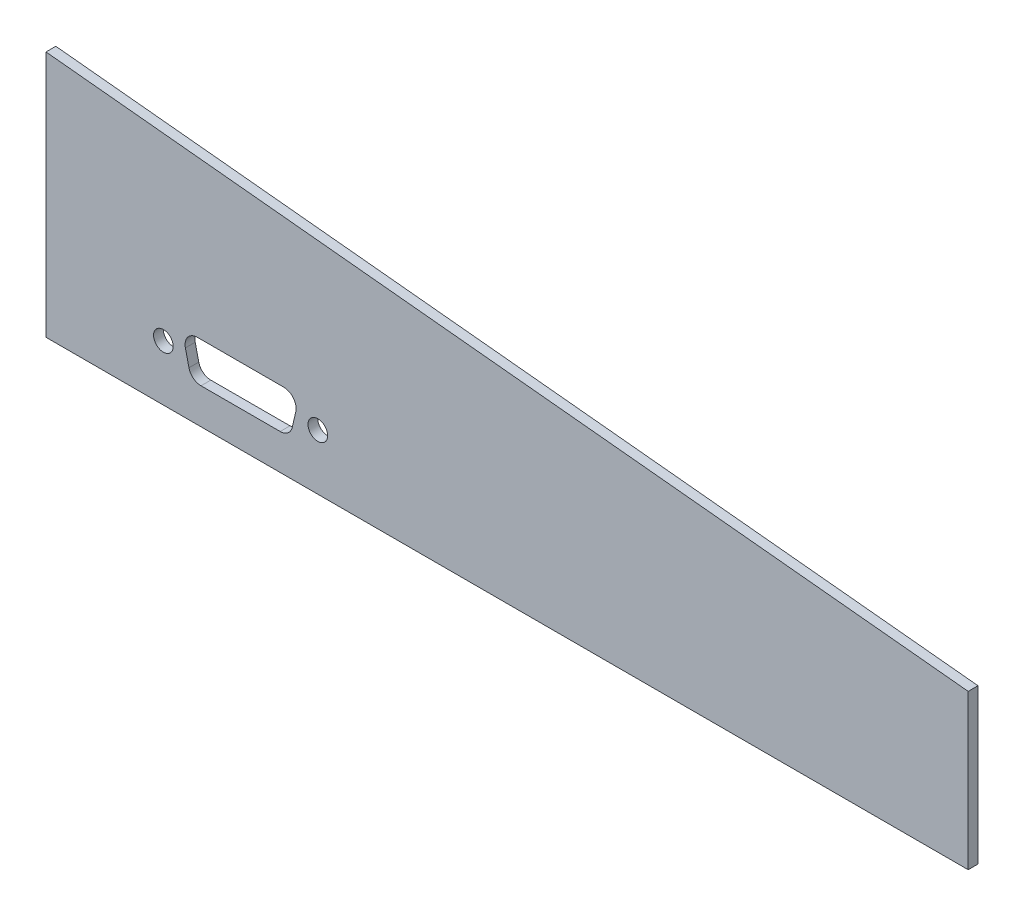
ISO-10303-21;
HEADER;
FILE_DESCRIPTION(('STEP AP214'),'2;1');
FILE_NAME('part.step','',(''),(''),'','','');
FILE_SCHEMA(('AUTOMOTIVE_DESIGN { 1 0 10303 214 1 1 1 1 }'));
ENDSEC;
DATA;
#1=APPLICATION_CONTEXT('core data for automotive mechanical design processes');
#2=APPLICATION_PROTOCOL_DEFINITION('international standard','automotive_design',2000,#1);
#3=PRODUCT_CONTEXT('',#1,'mechanical');
#4=PRODUCT('Part','Part','',(#3));
#5=PRODUCT_RELATED_PRODUCT_CATEGORY('part','',(#4));
#6=PRODUCT_DEFINITION_FORMATION('','',#4);
#7=PRODUCT_DEFINITION_CONTEXT('part definition',#1,'design');
#8=PRODUCT_DEFINITION('design','',#6,#7);
#9=PRODUCT_DEFINITION_SHAPE('','',#8);
#10=(LENGTH_UNIT() NAMED_UNIT(*) SI_UNIT(.MILLI.,.METRE.));
#11=(NAMED_UNIT(*) PLANE_ANGLE_UNIT() SI_UNIT($,.RADIAN.));
#12=(NAMED_UNIT(*) SI_UNIT($,.STERADIAN.) SOLID_ANGLE_UNIT());
#13=UNCERTAINTY_MEASURE_WITH_UNIT(LENGTH_MEASURE(1.E-05),#10,'distance_accuracy_value','');
#14=(GEOMETRIC_REPRESENTATION_CONTEXT(3) GLOBAL_UNCERTAINTY_ASSIGNED_CONTEXT((#13)) GLOBAL_UNIT_ASSIGNED_CONTEXT((#10,
#11,#12)) REPRESENTATION_CONTEXT('',''));
#15=CARTESIAN_POINT('',(0.,0.,0.));
#16=DIRECTION('',(0.,0.,1.));
#17=DIRECTION('',(1.,0.,0.));
#18=AXIS2_PLACEMENT_3D('',#15,#16,#17);
#19=CARTESIAN_POINT('',(0.,0.,1.5875));
#20=DIRECTION('',(0.,0.,1.));
#21=DIRECTION('',(1.,0.,0.));
#22=AXIS2_PLACEMENT_3D('',#19,#20,#21);
#23=PLANE('',#22);
#24=CARTESIAN_POINT('',(-130.248115565993,9.,1.5875));
#25=DIRECTION('',(0.,0.,1.));
#26=DIRECTION('',(1.,0.,0.));
#27=AXIS2_PLACEMENT_3D('',#24,#25,#26);
#28=CIRCLE('',#27,1.59000000000001);
#29=CARTESIAN_POINT('',(-128.658115565993,9.,1.5875));
#30=VERTEX_POINT('',#29);
#31=EDGE_CURVE('E217',#30,#30,#28,.T.);
#32=ORIENTED_EDGE('',*,*,#31,.F.);
#33=EDGE_LOOP('',(#32));
#34=FACE_BOUND('',#33,.T.);
#35=DIRECTION('',(-0.99498743710662,0.1,0.));
#36=VECTOR('',#35,1.);
#37=CARTESIAN_POINT('',(0.,25.,1.5875));
#38=LINE('',#37,#36);
#39=CARTESIAN_POINT('',(0.,25.,1.5875));
#40=VERTEX_POINT('',#39);
#41=CARTESIAN_POINT('',(-149.248115565993,40.,1.5875));
#42=VERTEX_POINT('',#41);
#43=EDGE_CURVE('E133',#40,#42,#38,.T.);
#44=ORIENTED_EDGE('',*,*,#43,.T.);
#45=DIRECTION('',(0.,-1.,0.));
#46=VECTOR('',#45,1.);
#47=CARTESIAN_POINT('',(-149.248115565993,40.,1.5875));
#48=LINE('',#47,#46);
#49=CARTESIAN_POINT('',(-149.248115565993,0.,1.5875));
#50=VERTEX_POINT('',#49);
#51=EDGE_CURVE('E122',#42,#50,#48,.T.);
#52=ORIENTED_EDGE('',*,*,#51,.T.);
#53=DIRECTION('',(1.,0.,0.));
#54=VECTOR('',#53,1.);
#55=CARTESIAN_POINT('',(-149.248115565993,0.,1.5875));
#56=LINE('',#55,#54);
#57=CARTESIAN_POINT('',(0.,0.,1.5875));
#58=VERTEX_POINT('',#57);
#59=EDGE_CURVE('E132',#50,#58,#56,.T.);
#60=ORIENTED_EDGE('',*,*,#59,.T.);
#61=DIRECTION('',(0.,1.,0.));
#62=VECTOR('',#61,1.);
#63=CARTESIAN_POINT('',(0.,0.,1.5875));
#64=LINE('',#63,#62);
#65=EDGE_CURVE('E137',#58,#40,#64,.T.);
#66=ORIENTED_EDGE('',*,*,#65,.T.);
#67=EDGE_LOOP('',(#44,#52,#60,#66));
#68=FACE_BOUND('',#67,.T.);
#69=DIRECTION('',(1.,0.,0.));
#70=VECTOR('',#69,1.);
#71=CARTESIAN_POINT('',(-109.753115565993,5.75,1.5875));
#72=LINE('',#71,#70);
#73=CARTESIAN_POINT('',(-124.162090325358,5.75,1.5875));
#74=VERTEX_POINT('',#73);
#75=CARTESIAN_POINT('',(-111.344140806628,5.75,1.5875));
#76=VERTEX_POINT('',#75);
#77=EDGE_CURVE('E202',#74,#76,#72,.T.);
#78=ORIENTED_EDGE('',*,*,#77,.F.);
#79=CARTESIAN_POINT('',(-124.162090325358,7.75,1.5875));
#80=DIRECTION('',(0.,0.,1.));
#81=DIRECTION('',(1.,0.,0.));
#82=AXIS2_PLACEMENT_3D('',#79,#80,#81);
#83=CIRCLE('',#82,2.);
#84=CARTESIAN_POINT('',(-126.110872716747,7.30028098660248,1.5875));
#85=VERTEX_POINT('',#84);
#86=EDGE_CURVE('E11',#74,#85,#83,.F.);
#87=ORIENTED_EDGE('',*,*,#86,.T.);
#88=DIRECTION('',(0.224859506698759,-0.97439119569462,0.));
#89=VECTOR('',#88,1.);
#90=CARTESIAN_POINT('',(-125.753115565993,5.75,1.5875));
#91=LINE('',#90,#89);
#92=CARTESIAN_POINT('',(-126.687795793671,9.80028098660249,1.5875));
#93=VERTEX_POINT('',#92);
#94=EDGE_CURVE('E200',#93,#85,#91,.T.);
#95=ORIENTED_EDGE('',*,*,#94,.F.);
#96=CARTESIAN_POINT('',(-124.739013402281,10.25,1.5875));
#97=DIRECTION('',(0.,0.,1.));
#98=DIRECTION('',(1.,0.,0.));
#99=AXIS2_PLACEMENT_3D('',#96,#97,#98);
#100=CIRCLE('',#99,2.);
#101=CARTESIAN_POINT('',(-124.739013402281,12.25,1.5875));
#102=VERTEX_POINT('',#101);
#103=EDGE_CURVE('E180',#93,#102,#100,.F.);
#104=ORIENTED_EDGE('',*,*,#103,.T.);
#105=DIRECTION('',(-1.,0.,0.));
#106=VECTOR('',#105,1.);
#107=CARTESIAN_POINT('',(-127.253115565993,12.25,1.5875));
#108=LINE('',#107,#106);
#109=CARTESIAN_POINT('',(-110.767217729705,12.25,1.5875));
#110=VERTEX_POINT('',#109);
#111=EDGE_CURVE('E214',#110,#102,#108,.T.);
#112=ORIENTED_EDGE('',*,*,#111,.F.);
#113=CARTESIAN_POINT('',(-110.767217729705,10.25,1.5875));
#114=DIRECTION('',(0.,0.,1.));
#115=DIRECTION('',(1.,0.,0.));
#116=AXIS2_PLACEMENT_3D('',#113,#114,#115);
#117=CIRCLE('',#116,2.);
#118=CARTESIAN_POINT('',(-108.818435338315,9.80028098660248,1.5875));
#119=VERTEX_POINT('',#118);
#120=EDGE_CURVE('E172',#110,#119,#117,.F.);
#121=ORIENTED_EDGE('',*,*,#120,.T.);
#122=DIRECTION('',(0.224859506698759,0.97439119569462,0.));
#123=VECTOR('',#122,1.);
#124=CARTESIAN_POINT('',(-108.253115565993,12.25,1.5875));
#125=LINE('',#124,#123);
#126=CARTESIAN_POINT('',(-109.395358415239,7.30028098660248,1.5875));
#127=VERTEX_POINT('',#126);
#128=EDGE_CURVE('E205',#127,#119,#125,.T.);
#129=ORIENTED_EDGE('',*,*,#128,.F.);
#130=CARTESIAN_POINT('',(-111.344140806628,7.75,1.5875));
#131=DIRECTION('',(0.,0.,1.));
#132=DIRECTION('',(1.,0.,0.));
#133=AXIS2_PLACEMENT_3D('',#130,#131,#132);
#134=CIRCLE('',#133,2.);
#135=EDGE_CURVE('E176',#127,#76,#134,.F.);
#136=ORIENTED_EDGE('',*,*,#135,.T.);
#137=EDGE_LOOP('',(#78,#87,#95,#104,#112,#121,#129,#136));
#138=FACE_BOUND('',#137,.T.);
#139=CARTESIAN_POINT('',(-105.258115565993,9.,1.5875));
#140=DIRECTION('',(0.,0.,1.));
#141=DIRECTION('',(1.,0.,0.));
#142=AXIS2_PLACEMENT_3D('',#139,#140,#141);
#143=CIRCLE('',#142,1.59000000000001);
#144=CARTESIAN_POINT('',(-103.668115565993,9.,1.5875));
#145=VERTEX_POINT('',#144);
#146=EDGE_CURVE('E285',#145,#145,#143,.T.);
#147=ORIENTED_EDGE('',*,*,#146,.F.);
#148=EDGE_LOOP('',(#147));
#149=FACE_BOUND('',#148,.T.);
#150=ADVANCED_FACE('F33',(#34,#68,#138,#149),#23,.T.);
#151=CARTESIAN_POINT('',(0.,0.,0.));
#152=DIRECTION('',(0.,0.,1.));
#153=DIRECTION('',(1.,0.,0.));
#154=AXIS2_PLACEMENT_3D('',#151,#152,#153);
#155=PLANE('',#154);
#156=DIRECTION('',(-0.99498743710662,0.1,0.));
#157=VECTOR('',#156,1.);
#158=CARTESIAN_POINT('',(0.,25.,0.));
#159=LINE('',#158,#157);
#160=CARTESIAN_POINT('',(0.,25.,0.));
#161=VERTEX_POINT('',#160);
#162=CARTESIAN_POINT('',(-149.248115565993,40.,0.));
#163=VERTEX_POINT('',#162);
#164=EDGE_CURVE('E145',#161,#163,#159,.T.);
#165=ORIENTED_EDGE('',*,*,#164,.F.);
#166=DIRECTION('',(0.,1.,0.));
#167=VECTOR('',#166,1.);
#168=CARTESIAN_POINT('',(0.,0.,0.));
#169=LINE('',#168,#167);
#170=CARTESIAN_POINT('',(0.,0.,0.));
#171=VERTEX_POINT('',#170);
#172=EDGE_CURVE('E141',#171,#161,#169,.T.);
#173=ORIENTED_EDGE('',*,*,#172,.F.);
#174=DIRECTION('',(1.,0.,0.));
#175=VECTOR('',#174,1.);
#176=CARTESIAN_POINT('',(-149.248115565993,0.,0.));
#177=LINE('',#176,#175);
#178=CARTESIAN_POINT('',(-149.248115565993,0.,0.));
#179=VERTEX_POINT('',#178);
#180=EDGE_CURVE('E227',#179,#171,#177,.T.);
#181=ORIENTED_EDGE('',*,*,#180,.F.);
#182=DIRECTION('',(0.,-1.,0.));
#183=VECTOR('',#182,1.);
#184=CARTESIAN_POINT('',(-149.248115565993,40.,0.));
#185=LINE('',#184,#183);
#186=EDGE_CURVE('E225',#163,#179,#185,.T.);
#187=ORIENTED_EDGE('',*,*,#186,.F.);
#188=EDGE_LOOP('',(#165,#173,#181,#187));
#189=FACE_BOUND('',#188,.T.);
#190=DIRECTION('',(-1.,0.,0.));
#191=VECTOR('',#190,1.);
#192=CARTESIAN_POINT('',(-127.253115565993,12.25,0.));
#193=LINE('',#192,#191);
#194=CARTESIAN_POINT('',(-110.767217729705,12.25,0.));
#195=VERTEX_POINT('',#194);
#196=CARTESIAN_POINT('',(-124.739013402281,12.25,0.));
#197=VERTEX_POINT('',#196);
#198=EDGE_CURVE('E203',#195,#197,#193,.T.);
#199=ORIENTED_EDGE('',*,*,#198,.T.);
#200=CARTESIAN_POINT('',(-124.739013402281,10.25,0.));
#201=DIRECTION('',(0.,0.,1.));
#202=DIRECTION('',(1.,0.,0.));
#203=AXIS2_PLACEMENT_3D('',#200,#201,#202);
#204=CIRCLE('',#203,2.);
#205=CARTESIAN_POINT('',(-126.687795793671,9.80028098660249,0.));
#206=VERTEX_POINT('',#205);
#207=EDGE_CURVE('E178',#197,#206,#204,.T.);
#208=ORIENTED_EDGE('',*,*,#207,.T.);
#209=DIRECTION('',(0.224859506698759,-0.97439119569462,0.));
#210=VECTOR('',#209,1.);
#211=CARTESIAN_POINT('',(-125.753115565993,5.75,0.));
#212=LINE('',#211,#210);
#213=CARTESIAN_POINT('',(-126.110872716747,7.30028098660248,0.));
#214=VERTEX_POINT('',#213);
#215=EDGE_CURVE('E189',#206,#214,#212,.T.);
#216=ORIENTED_EDGE('',*,*,#215,.T.);
#217=CARTESIAN_POINT('',(-124.162090325358,7.75,0.));
#218=DIRECTION('',(0.,0.,1.));
#219=DIRECTION('',(1.,0.,0.));
#220=AXIS2_PLACEMENT_3D('',#217,#218,#219);
#221=CIRCLE('',#220,2.);
#222=CARTESIAN_POINT('',(-124.162090325358,5.75,0.));
#223=VERTEX_POINT('',#222);
#224=EDGE_CURVE('E41',#214,#223,#221,.T.);
#225=ORIENTED_EDGE('',*,*,#224,.T.);
#226=DIRECTION('',(1.,0.,0.));
#227=VECTOR('',#226,1.);
#228=CARTESIAN_POINT('',(-109.753115565993,5.75,0.));
#229=LINE('',#228,#227);
#230=CARTESIAN_POINT('',(-111.344140806628,5.75,0.));
#231=VERTEX_POINT('',#230);
#232=EDGE_CURVE('E188',#223,#231,#229,.T.);
#233=ORIENTED_EDGE('',*,*,#232,.T.);
#234=CARTESIAN_POINT('',(-111.344140806628,7.75,0.));
#235=DIRECTION('',(0.,0.,1.));
#236=DIRECTION('',(1.,0.,0.));
#237=AXIS2_PLACEMENT_3D('',#234,#235,#236);
#238=CIRCLE('',#237,2.);
#239=CARTESIAN_POINT('',(-109.395358415239,7.30028098660248,0.));
#240=VERTEX_POINT('',#239);
#241=EDGE_CURVE('E174',#231,#240,#238,.T.);
#242=ORIENTED_EDGE('',*,*,#241,.T.);
#243=DIRECTION('',(0.224859506698759,0.97439119569462,0.));
#244=VECTOR('',#243,1.);
#245=CARTESIAN_POINT('',(-108.253115565993,12.25,0.));
#246=LINE('',#245,#244);
#247=CARTESIAN_POINT('',(-108.818435338315,9.80028098660248,0.));
#248=VERTEX_POINT('',#247);
#249=EDGE_CURVE('E197',#240,#248,#246,.T.);
#250=ORIENTED_EDGE('',*,*,#249,.T.);
#251=CARTESIAN_POINT('',(-110.767217729705,10.25,0.));
#252=DIRECTION('',(0.,0.,1.));
#253=DIRECTION('',(1.,0.,0.));
#254=AXIS2_PLACEMENT_3D('',#251,#252,#253);
#255=CIRCLE('',#254,2.);
#256=EDGE_CURVE('E170',#248,#195,#255,.T.);
#257=ORIENTED_EDGE('',*,*,#256,.T.);
#258=EDGE_LOOP('',(#199,#208,#216,#225,#233,#242,#250,#257));
#259=FACE_BOUND('',#258,.T.);
#260=CARTESIAN_POINT('',(-130.248115565993,9.,0.));
#261=DIRECTION('',(0.,0.,1.));
#262=DIRECTION('',(1.,0.,0.));
#263=AXIS2_PLACEMENT_3D('',#260,#261,#262);
#264=CIRCLE('',#263,1.59000000000001);
#265=CARTESIAN_POINT('',(-128.658115565993,9.,0.));
#266=VERTEX_POINT('',#265);
#267=EDGE_CURVE('E209',#266,#266,#264,.T.);
#268=ORIENTED_EDGE('',*,*,#267,.T.);
#269=EDGE_LOOP('',(#268));
#270=FACE_BOUND('',#269,.T.);
#271=CARTESIAN_POINT('',(-105.258115565993,9.,0.));
#272=DIRECTION('',(0.,0.,1.));
#273=DIRECTION('',(1.,0.,0.));
#274=AXIS2_PLACEMENT_3D('',#271,#272,#273);
#275=CIRCLE('',#274,1.59000000000001);
#276=CARTESIAN_POINT('',(-103.668115565993,9.,0.));
#277=VERTEX_POINT('',#276);
#278=EDGE_CURVE('E288',#277,#277,#275,.T.);
#279=ORIENTED_EDGE('',*,*,#278,.T.);
#280=EDGE_LOOP('',(#279));
#281=FACE_BOUND('',#280,.T.);
#282=ADVANCED_FACE('F186',(#189,#259,#270,#281),#155,.F.);
#283=CARTESIAN_POINT('',(0.,25.,1.5875));
#284=DIRECTION('',(-0.1,-0.99498743710662,0.));
#285=DIRECTION('',(0.99498743710662,-0.1,0.));
#286=AXIS2_PLACEMENT_3D('',#283,#284,#285);
#287=PLANE('',#286);
#288=ORIENTED_EDGE('',*,*,#164,.T.);
#289=DIRECTION('',(0.,0.,-1.));
#290=VECTOR('',#289,1.);
#291=CARTESIAN_POINT('',(-149.248115565993,40.,1.5875));
#292=LINE('',#291,#290);
#293=EDGE_CURVE('E126',#42,#163,#292,.T.);
#294=ORIENTED_EDGE('',*,*,#293,.F.);
#295=ORIENTED_EDGE('',*,*,#43,.F.);
#296=DIRECTION('',(0.,0.,-1.));
#297=VECTOR('',#296,1.);
#298=CARTESIAN_POINT('',(0.,25.,1.5875));
#299=LINE('',#298,#297);
#300=EDGE_CURVE('E223',#40,#161,#299,.T.);
#301=ORIENTED_EDGE('',*,*,#300,.T.);
#302=EDGE_LOOP('',(#288,#294,#295,#301));
#303=FACE_BOUND('',#302,.T.);
#304=ADVANCED_FACE('F143',(#303),#287,.F.);
#305=CARTESIAN_POINT('',(-149.248115565993,40.,1.5875));
#306=DIRECTION('',(1.,0.,0.));
#307=DIRECTION('',(0.,0.,-1.));
#308=AXIS2_PLACEMENT_3D('',#305,#306,#307);
#309=PLANE('',#308);
#310=ORIENTED_EDGE('',*,*,#186,.T.);
#311=DIRECTION('',(0.,0.,-1.));
#312=VECTOR('',#311,1.);
#313=CARTESIAN_POINT('',(-149.248115565993,0.,1.5875));
#314=LINE('',#313,#312);
#315=EDGE_CURVE('E129',#50,#179,#314,.T.);
#316=ORIENTED_EDGE('',*,*,#315,.F.);
#317=ORIENTED_EDGE('',*,*,#51,.F.);
#318=ORIENTED_EDGE('',*,*,#293,.T.);
#319=EDGE_LOOP('',(#310,#316,#317,#318));
#320=FACE_BOUND('',#319,.T.);
#321=ADVANCED_FACE('F124',(#320),#309,.F.);
#322=CARTESIAN_POINT('',(-149.248115565993,0.,1.5875));
#323=DIRECTION('',(0.,1.,0.));
#324=DIRECTION('',(0.,0.,1.));
#325=AXIS2_PLACEMENT_3D('',#322,#323,#324);
#326=PLANE('',#325);
#327=ORIENTED_EDGE('',*,*,#180,.T.);
#328=DIRECTION('',(0.,0.,-1.));
#329=VECTOR('',#328,1.);
#330=CARTESIAN_POINT('',(0.,0.,1.5875));
#331=LINE('',#330,#329);
#332=EDGE_CURVE('E150',#58,#171,#331,.T.);
#333=ORIENTED_EDGE('',*,*,#332,.F.);
#334=ORIENTED_EDGE('',*,*,#59,.F.);
#335=ORIENTED_EDGE('',*,*,#315,.T.);
#336=EDGE_LOOP('',(#327,#333,#334,#335));
#337=FACE_BOUND('',#336,.T.);
#338=ADVANCED_FACE('F238',(#337),#326,.F.);
#339=CARTESIAN_POINT('',(0.,0.,1.5875));
#340=DIRECTION('',(-1.,0.,0.));
#341=DIRECTION('',(0.,0.,1.));
#342=AXIS2_PLACEMENT_3D('',#339,#340,#341);
#343=PLANE('',#342);
#344=ORIENTED_EDGE('',*,*,#172,.T.);
#345=ORIENTED_EDGE('',*,*,#300,.F.);
#346=ORIENTED_EDGE('',*,*,#65,.F.);
#347=ORIENTED_EDGE('',*,*,#332,.T.);
#348=EDGE_LOOP('',(#344,#345,#346,#347));
#349=FACE_BOUND('',#348,.T.);
#350=ADVANCED_FACE('F234',(#349),#343,.F.);
#351=CARTESIAN_POINT('',(-125.753115565993,5.75,1.5875));
#352=DIRECTION('',(0.97439119569462,0.224859506698759,0.));
#353=DIRECTION('',(-0.224859506698759,0.97439119569462,0.));
#354=AXIS2_PLACEMENT_3D('',#351,#352,#353);
#355=PLANE('',#354);
#356=ORIENTED_EDGE('',*,*,#215,.F.);
#357=DIRECTION('',(0.,0.,-1.));
#358=VECTOR('',#357,1.);
#359=CARTESIAN_POINT('',(-126.687795793671,9.80028098660249,1.5875));
#360=LINE('',#359,#358);
#361=EDGE_CURVE('E53',#206,#93,#360,.F.);
#362=ORIENTED_EDGE('',*,*,#361,.T.);
#363=ORIENTED_EDGE('',*,*,#94,.T.);
#364=DIRECTION('',(0.,0.,-1.));
#365=VECTOR('',#364,1.);
#366=CARTESIAN_POINT('',(-126.110872716747,7.30028098660248,0.));
#367=LINE('',#366,#365);
#368=EDGE_CURVE('E166',#85,#214,#367,.T.);
#369=ORIENTED_EDGE('',*,*,#368,.T.);
#370=EDGE_LOOP('',(#356,#362,#363,#369));
#371=FACE_BOUND('',#370,.T.);
#372=ADVANCED_FACE('F199',(#371),#355,.T.);
#373=CARTESIAN_POINT('',(-109.753115565993,5.75,1.5875));
#374=DIRECTION('',(0.,1.,0.));
#375=DIRECTION('',(0.,0.,1.));
#376=AXIS2_PLACEMENT_3D('',#373,#374,#375);
#377=PLANE('',#376);
#378=ORIENTED_EDGE('',*,*,#77,.T.);
#379=DIRECTION('',(0.,0.,-1.));
#380=VECTOR('',#379,1.);
#381=CARTESIAN_POINT('',(-111.344140806628,5.75,0.));
#382=LINE('',#381,#380);
#383=EDGE_CURVE('E163',#76,#231,#382,.T.);
#384=ORIENTED_EDGE('',*,*,#383,.T.);
#385=ORIENTED_EDGE('',*,*,#232,.F.);
#386=DIRECTION('',(0.,0.,-1.));
#387=VECTOR('',#386,1.);
#388=CARTESIAN_POINT('',(-124.162090325358,5.75,1.5875));
#389=LINE('',#388,#387);
#390=EDGE_CURVE('E161',#223,#74,#389,.F.);
#391=ORIENTED_EDGE('',*,*,#390,.T.);
#392=EDGE_LOOP('',(#378,#384,#385,#391));
#393=FACE_BOUND('',#392,.T.);
#394=ADVANCED_FACE('F195',(#393),#377,.T.);
#395=CARTESIAN_POINT('',(-108.253115565993,12.25,1.5875));
#396=DIRECTION('',(-0.97439119569462,0.224859506698759,0.));
#397=DIRECTION('',(-0.224859506698759,-0.97439119569462,0.));
#398=AXIS2_PLACEMENT_3D('',#395,#396,#397);
#399=PLANE('',#398);
#400=ORIENTED_EDGE('',*,*,#128,.T.);
#401=DIRECTION('',(0.,0.,-1.));
#402=VECTOR('',#401,1.);
#403=CARTESIAN_POINT('',(-108.818435338315,9.80028098660248,0.));
#404=LINE('',#403,#402);
#405=EDGE_CURVE('E148',#119,#248,#404,.T.);
#406=ORIENTED_EDGE('',*,*,#405,.T.);
#407=ORIENTED_EDGE('',*,*,#249,.F.);
#408=DIRECTION('',(0.,0.,-1.));
#409=VECTOR('',#408,1.);
#410=CARTESIAN_POINT('',(-109.395358415239,7.30028098660248,1.5875));
#411=LINE('',#410,#409);
#412=EDGE_CURVE('E146',#240,#127,#411,.F.);
#413=ORIENTED_EDGE('',*,*,#412,.T.);
#414=EDGE_LOOP('',(#400,#406,#407,#413));
#415=FACE_BOUND('',#414,.T.);
#416=ADVANCED_FACE('F260',(#415),#399,.T.);
#417=CARTESIAN_POINT('',(-127.253115565993,12.25,1.5875));
#418=DIRECTION('',(0.,-1.,0.));
#419=DIRECTION('',(0.,0.,-1.));
#420=AXIS2_PLACEMENT_3D('',#417,#418,#419);
#421=PLANE('',#420);
#422=ORIENTED_EDGE('',*,*,#198,.F.);
#423=DIRECTION('',(0.,0.,-1.));
#424=VECTOR('',#423,1.);
#425=CARTESIAN_POINT('',(-110.767217729705,12.25,1.5875));
#426=LINE('',#425,#424);
#427=EDGE_CURVE('E159',#195,#110,#426,.F.);
#428=ORIENTED_EDGE('',*,*,#427,.T.);
#429=ORIENTED_EDGE('',*,*,#111,.T.);
#430=DIRECTION('',(0.,0.,-1.));
#431=VECTOR('',#430,1.);
#432=CARTESIAN_POINT('',(-124.739013402281,12.25,0.));
#433=LINE('',#432,#431);
#434=EDGE_CURVE('E156',#102,#197,#433,.T.);
#435=ORIENTED_EDGE('',*,*,#434,.T.);
#436=EDGE_LOOP('',(#422,#428,#429,#435));
#437=FACE_BOUND('',#436,.T.);
#438=ADVANCED_FACE('F263',(#437),#421,.T.);
#439=CARTESIAN_POINT('',(-130.248115565993,9.,1.5875));
#440=DIRECTION('',(0.,0.,-1.));
#441=DIRECTION('',(-1.,0.,0.));
#442=AXIS2_PLACEMENT_3D('',#439,#440,#441);
#443=CYLINDRICAL_SURFACE('',#442,1.59000000000001);
#444=ORIENTED_EDGE('',*,*,#31,.T.);
#445=EDGE_LOOP('',(#444));
#446=FACE_BOUND('',#445,.T.);
#447=ORIENTED_EDGE('',*,*,#267,.F.);
#448=EDGE_LOOP('',(#447));
#449=FACE_BOUND('',#448,.T.);
#450=ADVANCED_FACE('F267',(#446,#449),#443,.F.);
#451=CARTESIAN_POINT('',(-105.258115565993,9.,1.5875));
#452=DIRECTION('',(0.,0.,-1.));
#453=DIRECTION('',(-1.,0.,0.));
#454=AXIS2_PLACEMENT_3D('',#451,#452,#453);
#455=CYLINDRICAL_SURFACE('',#454,1.59000000000001);
#456=ORIENTED_EDGE('',*,*,#146,.T.);
#457=EDGE_LOOP('',(#456));
#458=FACE_BOUND('',#457,.T.);
#459=ORIENTED_EDGE('',*,*,#278,.F.);
#460=EDGE_LOOP('',(#459));
#461=FACE_BOUND('',#460,.T.);
#462=ADVANCED_FACE('F271',(#458,#461),#455,.F.);
#463=CARTESIAN_POINT('',(-110.767217729705,10.25,1.5875));
#464=DIRECTION('',(0.,0.,1.));
#465=DIRECTION('',(1.,0.,0.));
#466=AXIS2_PLACEMENT_3D('',#463,#464,#465);
#467=CYLINDRICAL_SURFACE('',#466,2.);
#468=ORIENTED_EDGE('',*,*,#120,.F.);
#469=ORIENTED_EDGE('',*,*,#427,.F.);
#470=ORIENTED_EDGE('',*,*,#256,.F.);
#471=ORIENTED_EDGE('',*,*,#405,.F.);
#472=EDGE_LOOP('',(#468,#469,#470,#471));
#473=FACE_BOUND('',#472,.T.);
#474=ADVANCED_FACE('F274',(#473),#467,.F.);
#475=CARTESIAN_POINT('',(-111.344140806628,7.75,1.5875));
#476=DIRECTION('',(0.,0.,1.));
#477=DIRECTION('',(1.,0.,0.));
#478=AXIS2_PLACEMENT_3D('',#475,#476,#477);
#479=CYLINDRICAL_SURFACE('',#478,2.);
#480=ORIENTED_EDGE('',*,*,#135,.F.);
#481=ORIENTED_EDGE('',*,*,#412,.F.);
#482=ORIENTED_EDGE('',*,*,#241,.F.);
#483=ORIENTED_EDGE('',*,*,#383,.F.);
#484=EDGE_LOOP('',(#480,#481,#482,#483));
#485=FACE_BOUND('',#484,.T.);
#486=ADVANCED_FACE('F279',(#485),#479,.F.);
#487=CARTESIAN_POINT('',(-124.739013402281,10.25,1.5875));
#488=DIRECTION('',(0.,0.,1.));
#489=DIRECTION('',(1.,0.,0.));
#490=AXIS2_PLACEMENT_3D('',#487,#488,#489);
#491=CYLINDRICAL_SURFACE('',#490,2.);
#492=ORIENTED_EDGE('',*,*,#103,.F.);
#493=ORIENTED_EDGE('',*,*,#361,.F.);
#494=ORIENTED_EDGE('',*,*,#207,.F.);
#495=ORIENTED_EDGE('',*,*,#434,.F.);
#496=EDGE_LOOP('',(#492,#493,#494,#495));
#497=FACE_BOUND('',#496,.T.);
#498=ADVANCED_FACE('F300',(#497),#491,.F.);
#499=CARTESIAN_POINT('',(-124.162090325358,7.75,1.5875));
#500=DIRECTION('',(0.,0.,1.));
#501=DIRECTION('',(1.,0.,0.));
#502=AXIS2_PLACEMENT_3D('',#499,#500,#501);
#503=CYLINDRICAL_SURFACE('',#502,2.);
#504=ORIENTED_EDGE('',*,*,#86,.F.);
#505=ORIENTED_EDGE('',*,*,#390,.F.);
#506=ORIENTED_EDGE('',*,*,#224,.F.);
#507=ORIENTED_EDGE('',*,*,#368,.F.);
#508=EDGE_LOOP('',(#504,#505,#506,#507));
#509=FACE_BOUND('',#508,.T.);
#510=ADVANCED_FACE('F35',(#509),#503,.F.);
#511=CLOSED_SHELL('',(#150,#282,#304,#321,#338,#350,#372,#394,#416,#438,#450,#462,#474,#486,
#498,#510));
#512=MANIFOLD_SOLID_BREP('B2',#511);
#513=ADVANCED_BREP_SHAPE_REPRESENTATION('',(#18,#512),#14);
#514=SHAPE_DEFINITION_REPRESENTATION(#9,#513);
ENDSEC;
END-ISO-10303-21;
